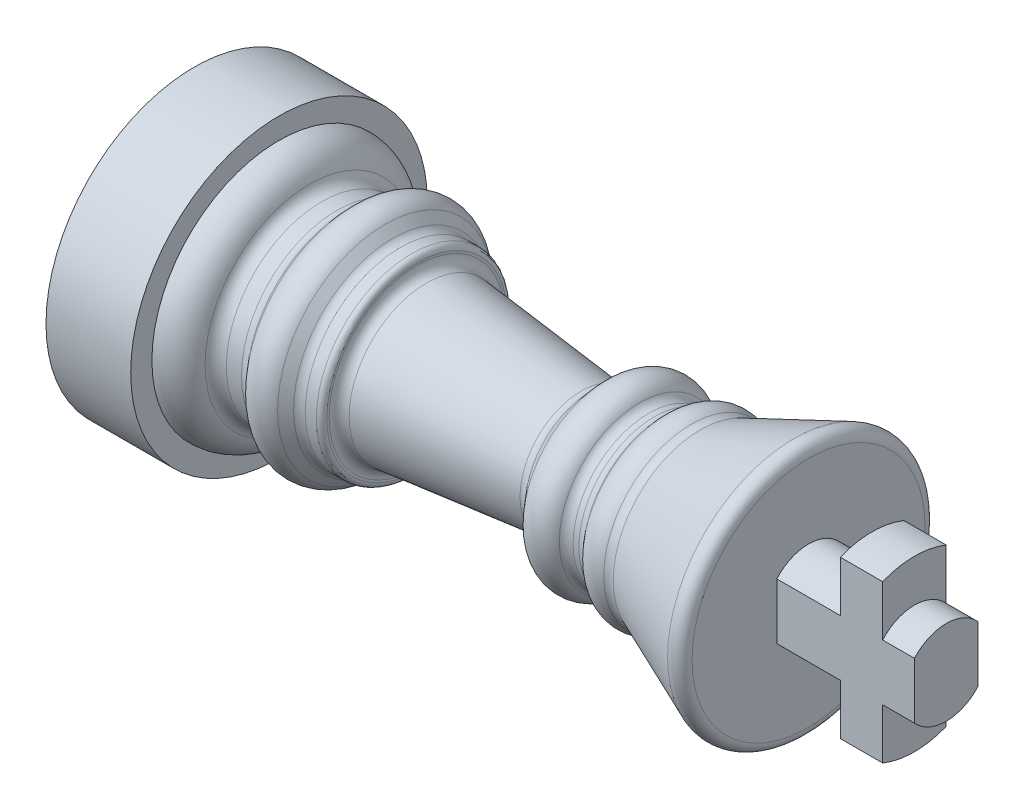
ISO-10303-21;
HEADER;
FILE_DESCRIPTION(('STEP AP214'),'2;1');
FILE_NAME('part.step','',(''),(''),'','','');
FILE_SCHEMA(('AUTOMOTIVE_DESIGN { 1 0 10303 214 1 1 1 1 }'));
ENDSEC;
DATA;
#1=APPLICATION_CONTEXT('core data for automotive mechanical design processes');
#2=APPLICATION_PROTOCOL_DEFINITION('international standard','automotive_design',2000,#1);
#3=PRODUCT_CONTEXT('',#1,'mechanical');
#4=PRODUCT('Part','Part','',(#3));
#5=PRODUCT_RELATED_PRODUCT_CATEGORY('part','',(#4));
#6=PRODUCT_DEFINITION_FORMATION('','',#4);
#7=PRODUCT_DEFINITION_CONTEXT('part definition',#1,'design');
#8=PRODUCT_DEFINITION('design','',#6,#7);
#9=PRODUCT_DEFINITION_SHAPE('','',#8);
#10=(LENGTH_UNIT() NAMED_UNIT(*) SI_UNIT(.MILLI.,.METRE.));
#11=(NAMED_UNIT(*) PLANE_ANGLE_UNIT() SI_UNIT($,.RADIAN.));
#12=(NAMED_UNIT(*) SI_UNIT($,.STERADIAN.) SOLID_ANGLE_UNIT());
#13=UNCERTAINTY_MEASURE_WITH_UNIT(LENGTH_MEASURE(1.E-05),#10,'distance_accuracy_value','');
#14=(GEOMETRIC_REPRESENTATION_CONTEXT(3) GLOBAL_UNCERTAINTY_ASSIGNED_CONTEXT((#13)) GLOBAL_UNIT_ASSIGNED_CONTEXT((#10,
#11,#12)) REPRESENTATION_CONTEXT('',''));
#15=CARTESIAN_POINT('',(0.,0.,0.));
#16=DIRECTION('',(0.,0.,1.));
#17=DIRECTION('',(1.,0.,0.));
#18=AXIS2_PLACEMENT_3D('',#15,#16,#17);
#19=CARTESIAN_POINT('',(0.,0.,0.));
#20=DIRECTION('',(-1.,0.,0.));
#21=DIRECTION('',(0.,0.,1.));
#22=AXIS2_PLACEMENT_3D('',#19,#20,#21);
#23=CYLINDRICAL_SURFACE('',#22,2.);
#24=DIRECTION('',(-1.,0.,0.));
#25=VECTOR('',#24,1.);
#26=CARTESIAN_POINT('',(0.,1.32287565553229,1.5));
#27=LINE('',#26,#25);
#28=CARTESIAN_POINT('',(31.5,1.32287565553229,1.5));
#29=VERTEX_POINT('',#28);
#30=CARTESIAN_POINT('',(28.5,1.32287565553229,1.5));
#31=VERTEX_POINT('',#30);
#32=EDGE_CURVE('E246',#29,#31,#27,.T.);
#33=ORIENTED_EDGE('',*,*,#32,.F.);
#34=CARTESIAN_POINT('',(31.5,0.,0.));
#35=DIRECTION('',(-1.,0.,0.));
#36=DIRECTION('',(0.,0.,1.));
#37=AXIS2_PLACEMENT_3D('',#34,#35,#36);
#38=CIRCLE('',#37,2.);
#39=CARTESIAN_POINT('',(31.5,1.3228756555323,-1.5));
#40=VERTEX_POINT('',#39);
#41=EDGE_CURVE('E146',#29,#40,#38,.T.);
#42=ORIENTED_EDGE('',*,*,#41,.T.);
#43=DIRECTION('',(-1.,0.,0.));
#44=VECTOR('',#43,1.);
#45=CARTESIAN_POINT('',(0.,1.32287565553229,-1.5));
#46=LINE('',#45,#44);
#47=CARTESIAN_POINT('',(28.5,1.32287565553229,-1.5));
#48=VERTEX_POINT('',#47);
#49=EDGE_CURVE('E242',#48,#40,#46,.F.);
#50=ORIENTED_EDGE('',*,*,#49,.F.);
#51=CARTESIAN_POINT('',(28.5,0.,0.));
#52=DIRECTION('',(-1.,0.,0.));
#53=DIRECTION('',(0.,0.,1.));
#54=AXIS2_PLACEMENT_3D('',#51,#52,#53);
#55=CIRCLE('',#54,2.);
#56=EDGE_CURVE('E140',#31,#48,#55,.T.);
#57=ORIENTED_EDGE('',*,*,#56,.F.);
#58=EDGE_LOOP('',(#33,#42,#50,#57));
#59=FACE_BOUND('',#58,.T.);
#60=ADVANCED_FACE('F34',(#59),#23,.T.);
#61=DIRECTION('',(-1.,0.,0.));
#62=VECTOR('',#61,1.);
#63=CARTESIAN_POINT('',(0.,-1.32287565553229,1.5));
#64=LINE('',#63,#62);
#65=CARTESIAN_POINT('',(28.5,-1.32287565553229,1.5));
#66=VERTEX_POINT('',#65);
#67=CARTESIAN_POINT('',(31.5,-1.32287565553229,1.5));
#68=VERTEX_POINT('',#67);
#69=EDGE_CURVE('E145',#66,#68,#64,.F.);
#70=ORIENTED_EDGE('',*,*,#69,.F.);
#71=CARTESIAN_POINT('',(28.5,-1.32287565553229,-1.5));
#72=VERTEX_POINT('',#71);
#73=EDGE_CURVE('E138',#72,#66,#55,.T.);
#74=ORIENTED_EDGE('',*,*,#73,.F.);
#75=DIRECTION('',(-1.,0.,0.));
#76=VECTOR('',#75,1.);
#77=CARTESIAN_POINT('',(0.,-1.32287565553229,-1.5));
#78=LINE('',#77,#76);
#79=CARTESIAN_POINT('',(31.5,-1.3228756555323,-1.5));
#80=VERTEX_POINT('',#79);
#81=EDGE_CURVE('E120',#80,#72,#78,.T.);
#82=ORIENTED_EDGE('',*,*,#81,.F.);
#83=EDGE_CURVE('E150',#80,#68,#38,.T.);
#84=ORIENTED_EDGE('',*,*,#83,.T.);
#85=EDGE_LOOP('',(#70,#74,#82,#84));
#86=FACE_BOUND('',#85,.T.);
#87=ADVANCED_FACE('F144',(#86),#23,.T.);
#88=CARTESIAN_POINT('',(31.5,4.,0.));
#89=DIRECTION('',(1.,0.,0.));
#90=DIRECTION('',(0.,0.,-1.));
#91=AXIS2_PLACEMENT_3D('',#88,#89,#90);
#92=PLANE('',#91);
#93=DIRECTION('',(0.,-1.,0.));
#94=VECTOR('',#93,1.);
#95=CARTESIAN_POINT('',(31.5,4.,1.5));
#96=LINE('',#95,#94);
#97=CARTESIAN_POINT('',(31.5,3.70809924354783,1.5));
#98=VERTEX_POINT('',#97);
#99=EDGE_CURVE('E248',#98,#29,#96,.T.);
#100=ORIENTED_EDGE('',*,*,#99,.F.);
#101=CARTESIAN_POINT('',(31.5,0.,0.));
#102=DIRECTION('',(-1.,0.,0.));
#103=DIRECTION('',(0.,0.,1.));
#104=AXIS2_PLACEMENT_3D('',#101,#102,#103);
#105=CIRCLE('',#104,4.);
#106=CARTESIAN_POINT('',(31.5,3.70809924354783,-1.5));
#107=VERTEX_POINT('',#106);
#108=EDGE_CURVE('E259',#98,#107,#105,.T.);
#109=ORIENTED_EDGE('',*,*,#108,.T.);
#110=DIRECTION('',(0.,1.,0.));
#111=VECTOR('',#110,1.);
#112=CARTESIAN_POINT('',(31.5,4.,-1.5));
#113=LINE('',#112,#111);
#114=EDGE_CURVE('E305',#40,#107,#113,.T.);
#115=ORIENTED_EDGE('',*,*,#114,.F.);
#116=ORIENTED_EDGE('',*,*,#41,.F.);
#117=EDGE_LOOP('',(#100,#109,#115,#116));
#118=FACE_BOUND('',#117,.T.);
#119=ADVANCED_FACE('F312',(#118),#92,.F.);
#120=CARTESIAN_POINT('',(31.5,-3.70809924354783,1.5));
#121=VERTEX_POINT('',#120);
#122=EDGE_CURVE('E270',#68,#121,#96,.T.);
#123=ORIENTED_EDGE('',*,*,#122,.F.);
#124=ORIENTED_EDGE('',*,*,#83,.F.);
#125=CARTESIAN_POINT('',(31.5,-3.70809924354783,-1.5));
#126=VERTEX_POINT('',#125);
#127=EDGE_CURVE('E126',#126,#80,#113,.T.);
#128=ORIENTED_EDGE('',*,*,#127,.F.);
#129=EDGE_CURVE('E258',#126,#121,#105,.T.);
#130=ORIENTED_EDGE('',*,*,#129,.T.);
#131=EDGE_LOOP('',(#123,#124,#128,#130));
#132=FACE_BOUND('',#131,.T.);
#133=ADVANCED_FACE('F269',(#132),#92,.F.);
#134=CARTESIAN_POINT('',(0.,0.,0.));
#135=DIRECTION('',(-1.,0.,0.));
#136=DIRECTION('',(0.,0.,1.));
#137=AXIS2_PLACEMENT_3D('',#134,#135,#136);
#138=CYLINDRICAL_SURFACE('',#137,4.);
#139=DIRECTION('',(-1.,0.,0.));
#140=VECTOR('',#139,1.);
#141=CARTESIAN_POINT('',(0.,3.70809924354783,1.5));
#142=LINE('',#141,#140);
#143=CARTESIAN_POINT('',(33.5,3.70809924354783,1.5));
#144=VERTEX_POINT('',#143);
#145=EDGE_CURVE('E289',#144,#98,#142,.T.);
#146=ORIENTED_EDGE('',*,*,#145,.F.);
#147=CARTESIAN_POINT('',(33.5,0.,0.));
#148=DIRECTION('',(-1.,0.,0.));
#149=DIRECTION('',(0.,0.,1.));
#150=AXIS2_PLACEMENT_3D('',#147,#148,#149);
#151=CIRCLE('',#150,4.);
#152=CARTESIAN_POINT('',(33.5,3.70809924354783,-1.5));
#153=VERTEX_POINT('',#152);
#154=EDGE_CURVE('E256',#144,#153,#151,.T.);
#155=ORIENTED_EDGE('',*,*,#154,.T.);
#156=DIRECTION('',(-1.,0.,0.));
#157=VECTOR('',#156,1.);
#158=CARTESIAN_POINT('',(0.,3.70809924354783,-1.5));
#159=LINE('',#158,#157);
#160=EDGE_CURVE('E303',#107,#153,#159,.F.);
#161=ORIENTED_EDGE('',*,*,#160,.F.);
#162=ORIENTED_EDGE('',*,*,#108,.F.);
#163=EDGE_LOOP('',(#146,#155,#161,#162));
#164=FACE_BOUND('',#163,.T.);
#165=ADVANCED_FACE('F298',(#164),#138,.T.);
#166=DIRECTION('',(-1.,0.,0.));
#167=VECTOR('',#166,1.);
#168=CARTESIAN_POINT('',(0.,-3.70809924354783,1.5));
#169=LINE('',#168,#167);
#170=CARTESIAN_POINT('',(33.5,-3.70809924354783,1.5));
#171=VERTEX_POINT('',#170);
#172=EDGE_CURVE('E278',#121,#171,#169,.F.);
#173=ORIENTED_EDGE('',*,*,#172,.F.);
#174=ORIENTED_EDGE('',*,*,#129,.F.);
#175=DIRECTION('',(-1.,0.,0.));
#176=VECTOR('',#175,1.);
#177=CARTESIAN_POINT('',(0.,-3.70809924354783,-1.5));
#178=LINE('',#177,#176);
#179=CARTESIAN_POINT('',(33.5,-3.70809924354783,-1.5));
#180=VERTEX_POINT('',#179);
#181=EDGE_CURVE('E276',#180,#126,#178,.T.);
#182=ORIENTED_EDGE('',*,*,#181,.F.);
#183=EDGE_CURVE('E255',#180,#171,#151,.T.);
#184=ORIENTED_EDGE('',*,*,#183,.T.);
#185=EDGE_LOOP('',(#173,#174,#182,#184));
#186=FACE_BOUND('',#185,.T.);
#187=ADVANCED_FACE('F274',(#186),#138,.T.);
#188=CARTESIAN_POINT('',(33.5,2.,0.));
#189=DIRECTION('',(-1.,0.,0.));
#190=DIRECTION('',(0.,0.,1.));
#191=AXIS2_PLACEMENT_3D('',#188,#189,#190);
#192=PLANE('',#191);
#193=DIRECTION('',(0.,1.,0.));
#194=VECTOR('',#193,1.);
#195=CARTESIAN_POINT('',(33.5,2.,1.5));
#196=LINE('',#195,#194);
#197=CARTESIAN_POINT('',(33.5,-1.32287565553229,1.5));
#198=VERTEX_POINT('',#197);
#199=EDGE_CURVE('E280',#171,#198,#196,.T.);
#200=ORIENTED_EDGE('',*,*,#199,.F.);
#201=ORIENTED_EDGE('',*,*,#183,.F.);
#202=DIRECTION('',(0.,-1.,0.));
#203=VECTOR('',#202,1.);
#204=CARTESIAN_POINT('',(33.5,2.,-1.5));
#205=LINE('',#204,#203);
#206=CARTESIAN_POINT('',(33.5,-1.3228756555323,-1.5));
#207=VERTEX_POINT('',#206);
#208=EDGE_CURVE('E241',#207,#180,#205,.T.);
#209=ORIENTED_EDGE('',*,*,#208,.F.);
#210=CARTESIAN_POINT('',(33.5,0.,0.));
#211=DIRECTION('',(-1.,0.,0.));
#212=DIRECTION('',(0.,0.,1.));
#213=AXIS2_PLACEMENT_3D('',#210,#211,#212);
#214=CIRCLE('',#213,2.);
#215=EDGE_CURVE('E240',#207,#198,#214,.T.);
#216=ORIENTED_EDGE('',*,*,#215,.T.);
#217=EDGE_LOOP('',(#200,#201,#209,#216));
#218=FACE_BOUND('',#217,.T.);
#219=ADVANCED_FACE('F489',(#218),#192,.F.);
#220=CARTESIAN_POINT('',(33.5,1.32287565553229,1.5));
#221=VERTEX_POINT('',#220);
#222=EDGE_CURVE('E284',#221,#144,#196,.T.);
#223=ORIENTED_EDGE('',*,*,#222,.F.);
#224=CARTESIAN_POINT('',(33.5,1.3228756555323,-1.5));
#225=VERTEX_POINT('',#224);
#226=EDGE_CURVE('E252',#221,#225,#214,.T.);
#227=ORIENTED_EDGE('',*,*,#226,.T.);
#228=EDGE_CURVE('E302',#153,#225,#205,.T.);
#229=ORIENTED_EDGE('',*,*,#228,.F.);
#230=ORIENTED_EDGE('',*,*,#154,.F.);
#231=EDGE_LOOP('',(#223,#227,#229,#230));
#232=FACE_BOUND('',#231,.T.);
#233=ADVANCED_FACE('F301',(#232),#192,.F.);
#234=CARTESIAN_POINT('',(0.,0.,0.));
#235=DIRECTION('',(-1.,0.,0.));
#236=DIRECTION('',(0.,0.,1.));
#237=AXIS2_PLACEMENT_3D('',#234,#235,#236);
#238=CYLINDRICAL_SURFACE('',#237,2.);
#239=DIRECTION('',(-1.,0.,0.));
#240=VECTOR('',#239,1.);
#241=CARTESIAN_POINT('',(0.,1.32287565553229,1.5));
#242=LINE('',#241,#240);
#243=CARTESIAN_POINT('',(35.,1.32287565553229,1.5));
#244=VERTEX_POINT('',#243);
#245=EDGE_CURVE('E288',#244,#221,#242,.T.);
#246=ORIENTED_EDGE('',*,*,#245,.F.);
#247=CARTESIAN_POINT('',(35.,0.,0.));
#248=DIRECTION('',(-1.,0.,0.));
#249=DIRECTION('',(0.,0.,1.));
#250=AXIS2_PLACEMENT_3D('',#247,#248,#249);
#251=CIRCLE('',#250,2.);
#252=CARTESIAN_POINT('',(35.,1.3228756555323,-1.5));
#253=VERTEX_POINT('',#252);
#254=EDGE_CURVE('E245',#244,#253,#251,.T.);
#255=ORIENTED_EDGE('',*,*,#254,.T.);
#256=DIRECTION('',(-1.,0.,0.));
#257=VECTOR('',#256,1.);
#258=CARTESIAN_POINT('',(0.,1.3228756555323,-1.5));
#259=LINE('',#258,#257);
#260=EDGE_CURVE('E56',#225,#253,#259,.F.);
#261=ORIENTED_EDGE('',*,*,#260,.F.);
#262=ORIENTED_EDGE('',*,*,#226,.F.);
#263=EDGE_LOOP('',(#246,#255,#261,#262));
#264=FACE_BOUND('',#263,.T.);
#265=ADVANCED_FACE('F484',(#264),#238,.T.);
#266=DIRECTION('',(-1.,0.,0.));
#267=VECTOR('',#266,1.);
#268=CARTESIAN_POINT('',(0.,-1.32287565553229,1.5));
#269=LINE('',#268,#267);
#270=CARTESIAN_POINT('',(35.,-1.32287565553229,1.5));
#271=VERTEX_POINT('',#270);
#272=EDGE_CURVE('E48',#198,#271,#269,.F.);
#273=ORIENTED_EDGE('',*,*,#272,.F.);
#274=ORIENTED_EDGE('',*,*,#215,.F.);
#275=DIRECTION('',(-1.,0.,0.));
#276=VECTOR('',#275,1.);
#277=CARTESIAN_POINT('',(0.,-1.3228756555323,-1.5));
#278=LINE('',#277,#276);
#279=CARTESIAN_POINT('',(35.,-1.3228756555323,-1.5));
#280=VERTEX_POINT('',#279);
#281=EDGE_CURVE('E228',#280,#207,#278,.T.);
#282=ORIENTED_EDGE('',*,*,#281,.F.);
#283=EDGE_CURVE('E238',#280,#271,#251,.T.);
#284=ORIENTED_EDGE('',*,*,#283,.T.);
#285=EDGE_LOOP('',(#273,#274,#282,#284));
#286=FACE_BOUND('',#285,.T.);
#287=ADVANCED_FACE('F237',(#286),#238,.T.);
#288=CARTESIAN_POINT('',(35.,0.,0.));
#289=DIRECTION('',(-1.,0.,0.));
#290=DIRECTION('',(0.,0.,1.));
#291=AXIS2_PLACEMENT_3D('',#288,#289,#290);
#292=PLANE('',#291);
#293=DIRECTION('',(0.,1.,0.));
#294=VECTOR('',#293,1.);
#295=CARTESIAN_POINT('',(35.,0.,1.5));
#296=LINE('',#295,#294);
#297=EDGE_CURVE('E12',#271,#244,#296,.T.);
#298=ORIENTED_EDGE('',*,*,#297,.F.);
#299=ORIENTED_EDGE('',*,*,#283,.F.);
#300=DIRECTION('',(0.,-1.,0.));
#301=VECTOR('',#300,1.);
#302=CARTESIAN_POINT('',(35.,0.,-1.5));
#303=LINE('',#302,#301);
#304=EDGE_CURVE('E42',#253,#280,#303,.T.);
#305=ORIENTED_EDGE('',*,*,#304,.F.);
#306=ORIENTED_EDGE('',*,*,#254,.F.);
#307=EDGE_LOOP('',(#298,#299,#305,#306));
#308=FACE_BOUND('',#307,.T.);
#309=ADVANCED_FACE('F244',(#308),#292,.F.);
#310=CARTESIAN_POINT('',(3.5,0.,0.));
#311=DIRECTION('',(-1.,0.,0.));
#312=DIRECTION('',(0.,0.,1.));
#313=AXIS2_PLACEMENT_3D('',#310,#311,#312);
#314=TOROIDAL_SURFACE('',#313,4.5,1.5);
#315=CARTESIAN_POINT('',(3.5,0.,0.));
#316=DIRECTION('',(-1.,0.,0.));
#317=DIRECTION('',(0.,0.,1.));
#318=AXIS2_PLACEMENT_3D('',#315,#316,#317);
#319=CIRCLE('',#318,6.);
#320=CARTESIAN_POINT('',(3.5,0.,6.));
#321=VERTEX_POINT('',#320);
#322=EDGE_CURVE('E219',#321,#321,#319,.T.);
#323=ORIENTED_EDGE('',*,*,#322,.F.);
#324=EDGE_LOOP('',(#323));
#325=FACE_BOUND('',#324,.T.);
#326=CARTESIAN_POINT('',(4.93747227124987,0.,0.));
#327=DIRECTION('',(-1.,0.,0.));
#328=DIRECTION('',(0.,0.,1.));
#329=AXIS2_PLACEMENT_3D('',#326,#327,#328);
#330=CIRCLE('',#329,4.92857142857143);
#331=CARTESIAN_POINT('',(4.93747227124987,0.,4.92857142857143));
#332=VERTEX_POINT('',#331);
#333=EDGE_CURVE('E216',#332,#332,#330,.T.);
#334=ORIENTED_EDGE('',*,*,#333,.T.);
#335=EDGE_LOOP('',(#334));
#336=FACE_BOUND('',#335,.T.);
#337=ADVANCED_FACE('F453',(#325,#336),#314,.T.);
#338=CARTESIAN_POINT('',(5.51246117974981,0.,0.));
#339=DIRECTION('',(-1.,0.,0.));
#340=DIRECTION('',(0.,0.,1.));
#341=AXIS2_PLACEMENT_3D('',#338,#339,#340);
#342=TOROIDAL_SURFACE('',#341,5.1,0.599999999999999);
#343=ORIENTED_EDGE('',*,*,#333,.F.);
#344=EDGE_LOOP('',(#343));
#345=FACE_BOUND('',#344,.T.);
#346=CARTESIAN_POINT('',(5.51246117974981,0.,0.));
#347=DIRECTION('',(-1.,0.,0.));
#348=DIRECTION('',(0.,0.,1.));
#349=AXIS2_PLACEMENT_3D('',#346,#347,#348);
#350=CIRCLE('',#349,4.5);
#351=CARTESIAN_POINT('',(5.51246117974981,0.,4.5));
#352=VERTEX_POINT('',#351);
#353=EDGE_CURVE('E213',#352,#352,#350,.T.);
#354=ORIENTED_EDGE('',*,*,#353,.T.);
#355=EDGE_LOOP('',(#354));
#356=FACE_BOUND('',#355,.T.);
#357=ADVANCED_FACE('F450',(#345,#356),#342,.F.);
#358=CARTESIAN_POINT('',(0.,0.,0.));
#359=DIRECTION('',(-1.,0.,0.));
#360=DIRECTION('',(0.,0.,1.));
#361=AXIS2_PLACEMENT_3D('',#358,#359,#360);
#362=CYLINDRICAL_SURFACE('',#361,4.5);
#363=ORIENTED_EDGE('',*,*,#353,.F.);
#364=EDGE_LOOP('',(#363));
#365=FACE_BOUND('',#364,.T.);
#366=CARTESIAN_POINT('',(6.227646036584,0.,0.));
#367=DIRECTION('',(-1.,0.,0.));
#368=DIRECTION('',(0.,0.,1.));
#369=AXIS2_PLACEMENT_3D('',#366,#367,#368);
#370=CIRCLE('',#369,4.5);
#371=CARTESIAN_POINT('',(6.227646036584,0.,4.5));
#372=VERTEX_POINT('',#371);
#373=EDGE_CURVE('E210',#372,#372,#370,.T.);
#374=ORIENTED_EDGE('',*,*,#373,.T.);
#375=EDGE_LOOP('',(#374));
#376=FACE_BOUND('',#375,.T.);
#377=ADVANCED_FACE('F446',(#365,#376),#362,.T.);
#378=CARTESIAN_POINT('',(6.227646036584,0.,0.));
#379=DIRECTION('',(-1.,0.,0.));
#380=DIRECTION('',(0.,0.,1.));
#381=AXIS2_PLACEMENT_3D('',#378,#379,#380);
#382=TOROIDAL_SURFACE('',#381,5.1,0.599999999999998);
#383=ORIENTED_EDGE('',*,*,#373,.F.);
#384=EDGE_LOOP('',(#383));
#385=FACE_BOUND('',#384,.T.);
#386=CARTESIAN_POINT('',(6.68047178471766,0.,0.));
#387=DIRECTION('',(-1.,0.,0.));
#388=DIRECTION('',(0.,0.,1.));
#389=AXIS2_PLACEMENT_3D('',#386,#387,#388);
#390=CIRCLE('',#389,4.7063645826057);
#391=CARTESIAN_POINT('',(6.68047178471766,0.,4.7063645826057));
#392=VERTEX_POINT('',#391);
#393=EDGE_CURVE('E207',#392,#392,#390,.T.);
#394=ORIENTED_EDGE('',*,*,#393,.T.);
#395=EDGE_LOOP('',(#394));
#396=FACE_BOUND('',#395,.T.);
#397=ADVANCED_FACE('F442',(#385,#396),#382,.F.);
#398=CARTESIAN_POINT('',(7.00108178990356,0.,0.));
#399=DIRECTION('',(1.,0.,0.));
#400=DIRECTION('',(0.,0.,-1.));
#401=AXIS2_PLACEMENT_3D('',#398,#399,#400);
#402=CONICAL_SURFACE('',#401,5.07518420361052,0.855211333477219);
#403=ORIENTED_EDGE('',*,*,#393,.F.);
#404=EDGE_LOOP('',(#403));
#405=FACE_BOUND('',#404,.T.);
#406=CARTESIAN_POINT('',(7.00108178990356,0.,0.));
#407=DIRECTION('',(-1.,0.,0.));
#408=DIRECTION('',(0.,0.,1.));
#409=AXIS2_PLACEMENT_3D('',#406,#407,#408);
#410=CIRCLE('',#409,5.07518420361052);
#411=CARTESIAN_POINT('',(7.00108178990356,0.,5.07518420361052));
#412=VERTEX_POINT('',#411);
#413=EDGE_CURVE('E204',#412,#412,#410,.T.);
#414=ORIENTED_EDGE('',*,*,#413,.T.);
#415=EDGE_LOOP('',(#414));
#416=FACE_BOUND('',#415,.T.);
#417=ADVANCED_FACE('F438',(#405,#416),#402,.T.);
#418=CARTESIAN_POINT('',(7.75579137012633,0.,0.));
#419=DIRECTION('',(-1.,0.,0.));
#420=DIRECTION('',(0.,0.,1.));
#421=AXIS2_PLACEMENT_3D('',#418,#419,#420);
#422=TOROIDAL_SURFACE('',#421,4.41912517462001,1.);
#423=ORIENTED_EDGE('',*,*,#413,.F.);
#424=EDGE_LOOP('',(#423));
#425=FACE_BOUND('',#424,.T.);
#426=CARTESIAN_POINT('',(8.51050095034911,0.,0.));
#427=DIRECTION('',(-1.,0.,0.));
#428=DIRECTION('',(0.,0.,1.));
#429=AXIS2_PLACEMENT_3D('',#426,#427,#428);
#430=CIRCLE('',#429,5.07518420361051);
#431=CARTESIAN_POINT('',(8.51050095034911,0.,5.07518420361051));
#432=VERTEX_POINT('',#431);
#433=EDGE_CURVE('E201',#432,#432,#430,.T.);
#434=ORIENTED_EDGE('',*,*,#433,.T.);
#435=EDGE_LOOP('',(#434));
#436=FACE_BOUND('',#435,.T.);
#437=ADVANCED_FACE('F434',(#425,#436),#422,.T.);
#438=CARTESIAN_POINT('',(8.86100928800401,0.,0.));
#439=DIRECTION('',(-1.,0.,0.));
#440=DIRECTION('',(0.,0.,1.));
#441=AXIS2_PLACEMENT_3D('',#438,#439,#440);
#442=CONICAL_SURFACE('',#441,4.67197048550475,0.855211333477227);
#443=ORIENTED_EDGE('',*,*,#433,.F.);
#444=EDGE_LOOP('',(#443));
#445=FACE_BOUND('',#444,.T.);
#446=CARTESIAN_POINT('',(8.86100928800401,0.,0.));
#447=DIRECTION('',(-1.,0.,0.));
#448=DIRECTION('',(0.,0.,1.));
#449=AXIS2_PLACEMENT_3D('',#446,#447,#448);
#450=CIRCLE('',#449,4.67197048550475);
#451=CARTESIAN_POINT('',(8.86100928800401,0.,4.67197048550475));
#452=VERTEX_POINT('',#451);
#453=EDGE_CURVE('E198',#452,#452,#450,.T.);
#454=ORIENTED_EDGE('',*,*,#453,.T.);
#455=EDGE_LOOP('',(#454));
#456=FACE_BOUND('',#455,.T.);
#457=ADVANCED_FACE('F430',(#445,#456),#442,.T.);
#458=CARTESIAN_POINT('',(9.2383640781154,0.,0.));
#459=DIRECTION('',(-1.,0.,0.));
#460=DIRECTION('',(0.,0.,1.));
#461=AXIS2_PLACEMENT_3D('',#458,#459,#460);
#462=TOROIDAL_SURFACE('',#461,5.,0.5);
#463=ORIENTED_EDGE('',*,*,#453,.F.);
#464=EDGE_LOOP('',(#463));
#465=FACE_BOUND('',#464,.T.);
#466=CARTESIAN_POINT('',(9.2383640781154,0.,0.));
#467=DIRECTION('',(-1.,0.,0.));
#468=DIRECTION('',(0.,0.,1.));
#469=AXIS2_PLACEMENT_3D('',#466,#467,#468);
#470=CIRCLE('',#469,4.5);
#471=CARTESIAN_POINT('',(9.2383640781154,0.,4.5));
#472=VERTEX_POINT('',#471);
#473=EDGE_CURVE('E195',#472,#472,#470,.T.);
#474=ORIENTED_EDGE('',*,*,#473,.T.);
#475=EDGE_LOOP('',(#474));
#476=FACE_BOUND('',#475,.T.);
#477=ADVANCED_FACE('F426',(#465,#476),#462,.F.);
#478=CARTESIAN_POINT('',(0.,0.,0.));
#479=DIRECTION('',(-1.,0.,0.));
#480=DIRECTION('',(0.,0.,1.));
#481=AXIS2_PLACEMENT_3D('',#478,#479,#480);
#482=CYLINDRICAL_SURFACE('',#481,4.5);
#483=CARTESIAN_POINT('',(9.76050095034911,0.,0.));
#484=DIRECTION('',(-1.,0.,0.));
#485=DIRECTION('',(0.,0.,1.));
#486=AXIS2_PLACEMENT_3D('',#483,#484,#485);
#487=CIRCLE('',#486,4.5);
#488=CARTESIAN_POINT('',(9.76050095034911,0.,4.5));
#489=VERTEX_POINT('',#488);
#490=EDGE_CURVE('E222',#489,#489,#487,.T.);
#491=ORIENTED_EDGE('',*,*,#490,.T.);
#492=EDGE_LOOP('',(#491));
#493=FACE_BOUND('',#492,.T.);
#494=ORIENTED_EDGE('',*,*,#473,.F.);
#495=EDGE_LOOP('',(#494));
#496=FACE_BOUND('',#495,.T.);
#497=ADVANCED_FACE('F422',(#493,#496),#482,.T.);
#498=CARTESIAN_POINT('',(10.0105009503491,4.5,0.));
#499=DIRECTION('',(-1.,0.,0.));
#500=DIRECTION('',(0.,0.,1.));
#501=AXIS2_PLACEMENT_3D('',#498,#499,#500);
#502=PLANE('',#501);
#503=CARTESIAN_POINT('',(10.0105009503491,0.,0.));
#504=DIRECTION('',(-1.,0.,0.));
#505=DIRECTION('',(0.,0.,1.));
#506=AXIS2_PLACEMENT_3D('',#503,#504,#505);
#507=CIRCLE('',#506,4.25);
#508=CARTESIAN_POINT('',(10.0105009503491,0.,4.25));
#509=VERTEX_POINT('',#508);
#510=EDGE_CURVE('E225',#509,#509,#507,.F.);
#511=ORIENTED_EDGE('',*,*,#510,.T.);
#512=EDGE_LOOP('',(#511));
#513=FACE_BOUND('',#512,.T.);
#514=CARTESIAN_POINT('',(10.0105009503491,0.,0.));
#515=DIRECTION('',(-1.,0.,0.));
#516=DIRECTION('',(0.,0.,1.));
#517=AXIS2_PLACEMENT_3D('',#514,#515,#516);
#518=CIRCLE('',#517,4.14516944142962);
#519=CARTESIAN_POINT('',(10.0105009503491,0.,4.14516944142962));
#520=VERTEX_POINT('',#519);
#521=EDGE_CURVE('E192',#520,#520,#518,.T.);
#522=ORIENTED_EDGE('',*,*,#521,.T.);
#523=EDGE_LOOP('',(#522));
#524=FACE_BOUND('',#523,.T.);
#525=ADVANCED_FACE('F418',(#513,#524),#502,.F.);
#526=CARTESIAN_POINT('',(10.5105009503491,0.,0.));
#527=DIRECTION('',(-1.,0.,0.));
#528=DIRECTION('',(0.,0.,1.));
#529=AXIS2_PLACEMENT_3D('',#526,#527,#528);
#530=TOROIDAL_SURFACE('',#529,4.14516944142962,0.500000000000001);
#531=ORIENTED_EDGE('',*,*,#521,.F.);
#532=EDGE_LOOP('',(#531));
#533=FACE_BOUND('',#532,.T.);
#534=CARTESIAN_POINT('',(10.4582367187153,0.,0.));
#535=DIRECTION('',(-1.,0.,0.));
#536=DIRECTION('',(0.,0.,1.));
#537=AXIS2_PLACEMENT_3D('',#534,#535,#536);
#538=CIRCLE('',#537,3.64790849374549);
#539=CARTESIAN_POINT('',(10.4582367187153,0.,3.64790849374549));
#540=VERTEX_POINT('',#539);
#541=EDGE_CURVE('E189',#540,#540,#538,.T.);
#542=ORIENTED_EDGE('',*,*,#541,.T.);
#543=EDGE_LOOP('',(#542));
#544=FACE_BOUND('',#543,.T.);
#545=ADVANCED_FACE('F414',(#533,#544),#530,.F.);
#546=CARTESIAN_POINT('',(17.7591010110446,0.,0.));
#547=DIRECTION('',(-1.,0.,0.));
#548=DIRECTION('',(0.,0.,1.));
#549=AXIS2_PLACEMENT_3D('',#546,#547,#548);
#550=CONICAL_SURFACE('',#549,2.88055673552174,0.104719755119659);
#551=ORIENTED_EDGE('',*,*,#541,.F.);
#552=EDGE_LOOP('',(#551));
#553=FACE_BOUND('',#552,.T.);
#554=CARTESIAN_POINT('',(17.7591010110446,0.,0.));
#555=DIRECTION('',(-1.,0.,0.));
#556=DIRECTION('',(0.,0.,1.));
#557=AXIS2_PLACEMENT_3D('',#554,#555,#556);
#558=CIRCLE('',#557,2.88055673552174);
#559=CARTESIAN_POINT('',(17.7591010110446,0.,2.88055673552174));
#560=VERTEX_POINT('',#559);
#561=EDGE_CURVE('E186',#560,#560,#558,.T.);
#562=ORIENTED_EDGE('',*,*,#561,.T.);
#563=EDGE_LOOP('',(#562));
#564=FACE_BOUND('',#563,.T.);
#565=ADVANCED_FACE('F410',(#553,#564),#550,.T.);
#566=CARTESIAN_POINT('',(17.8113652426784,0.,0.));
#567=DIRECTION('',(-1.,0.,0.));
#568=DIRECTION('',(0.,0.,1.));
#569=AXIS2_PLACEMENT_3D('',#566,#567,#568);
#570=TOROIDAL_SURFACE('',#569,3.37781768320587,0.499999999999998);
#571=ORIENTED_EDGE('',*,*,#561,.F.);
#572=EDGE_LOOP('',(#571));
#573=FACE_BOUND('',#572,.T.);
#574=CARTESIAN_POINT('',(18.1887200327898,0.,0.));
#575=DIRECTION('',(-1.,0.,0.));
#576=DIRECTION('',(0.,0.,1.));
#577=AXIS2_PLACEMENT_3D('',#574,#575,#576);
#578=CIRCLE('',#577,3.04978816871062);
#579=CARTESIAN_POINT('',(18.1887200327898,0.,3.04978816871062));
#580=VERTEX_POINT('',#579);
#581=EDGE_CURVE('E183',#580,#580,#578,.T.);
#582=ORIENTED_EDGE('',*,*,#581,.T.);
#583=EDGE_LOOP('',(#582));
#584=FACE_BOUND('',#583,.T.);
#585=ADVANCED_FACE('F406',(#573,#584),#570,.F.);
#586=CARTESIAN_POINT('',(18.9330649356096,0.,0.));
#587=DIRECTION('',(1.,0.,0.));
#588=DIRECTION('',(0.,0.,-1.));
#589=AXIS2_PLACEMENT_3D('',#586,#587,#588);
#590=CONICAL_SURFACE('',#589,3.90605902899051,0.855211333477217);
#591=ORIENTED_EDGE('',*,*,#581,.F.);
#592=EDGE_LOOP('',(#591));
#593=FACE_BOUND('',#592,.T.);
#594=CARTESIAN_POINT('',(18.9330649356096,0.,0.));
#595=DIRECTION('',(-1.,0.,0.));
#596=DIRECTION('',(0.,0.,1.));
#597=AXIS2_PLACEMENT_3D('',#594,#595,#596);
#598=CIRCLE('',#597,3.90605902899051);
#599=CARTESIAN_POINT('',(18.9330649356096,0.,3.90605902899051));
#600=VERTEX_POINT('',#599);
#601=EDGE_CURVE('E180',#600,#600,#598,.T.);
#602=ORIENTED_EDGE('',*,*,#601,.T.);
#603=EDGE_LOOP('',(#602));
#604=FACE_BOUND('',#603,.T.);
#605=ADVANCED_FACE('F402',(#593,#604),#590,.T.);
#606=CARTESIAN_POINT('',(19.6877745158324,0.,0.));
#607=DIRECTION('',(-1.,0.,0.));
#608=DIRECTION('',(0.,0.,1.));
#609=AXIS2_PLACEMENT_3D('',#606,#607,#608);
#610=TOROIDAL_SURFACE('',#609,3.25,1.);
#611=ORIENTED_EDGE('',*,*,#601,.F.);
#612=EDGE_LOOP('',(#611));
#613=FACE_BOUND('',#612,.T.);
#614=CARTESIAN_POINT('',(20.5277926651099,0.,0.));
#615=DIRECTION('',(-1.,0.,0.));
#616=DIRECTION('',(0.,0.,1.));
#617=AXIS2_PLACEMENT_3D('',#614,#615,#616);
#618=CIRCLE('',#617,3.79255829998655);
#619=CARTESIAN_POINT('',(20.5277926651099,0.,3.79255829998655));
#620=VERTEX_POINT('',#619);
#621=EDGE_CURVE('E177',#620,#620,#618,.T.);
#622=ORIENTED_EDGE('',*,*,#621,.T.);
#623=EDGE_LOOP('',(#622));
#624=FACE_BOUND('',#623,.T.);
#625=ADVANCED_FACE('F398',(#613,#624),#610,.T.);
#626=CARTESIAN_POINT('',(20.9478017397487,0.,0.));
#627=DIRECTION('',(-1.,0.,0.));
#628=DIRECTION('',(0.,0.,1.));
#629=AXIS2_PLACEMENT_3D('',#626,#627,#628);
#630=TOROIDAL_SURFACE('',#629,4.06383744997983,0.5);
#631=ORIENTED_EDGE('',*,*,#621,.F.);
#632=EDGE_LOOP('',(#631));
#633=FACE_BOUND('',#632,.T.);
#634=CARTESIAN_POINT('',(20.9478017397487,0.,0.));
#635=DIRECTION('',(-1.,0.,0.));
#636=DIRECTION('',(0.,0.,1.));
#637=AXIS2_PLACEMENT_3D('',#634,#635,#636);
#638=CIRCLE('',#637,3.56383744997983);
#639=CARTESIAN_POINT('',(20.9478017397487,0.,3.56383744997983));
#640=VERTEX_POINT('',#639);
#641=EDGE_CURVE('E174',#640,#640,#638,.T.);
#642=ORIENTED_EDGE('',*,*,#641,.T.);
#643=EDGE_LOOP('',(#642));
#644=FACE_BOUND('',#643,.T.);
#645=ADVANCED_FACE('F394',(#633,#644),#630,.F.);
#646=CARTESIAN_POINT('',(0.,0.,0.));
#647=DIRECTION('',(-1.,0.,0.));
#648=DIRECTION('',(0.,0.,1.));
#649=AXIS2_PLACEMENT_3D('',#646,#647,#648);
#650=CYLINDRICAL_SURFACE('',#649,3.56383744997983);
#651=ORIENTED_EDGE('',*,*,#641,.F.);
#652=EDGE_LOOP('',(#651));
#653=FACE_BOUND('',#652,.T.);
#654=CARTESIAN_POINT('',(21.2199386119824,0.,0.));
#655=DIRECTION('',(-1.,0.,0.));
#656=DIRECTION('',(0.,0.,1.));
#657=AXIS2_PLACEMENT_3D('',#654,#655,#656);
#658=CIRCLE('',#657,3.56383744997984);
#659=CARTESIAN_POINT('',(21.2199386119824,0.,3.56383744997984));
#660=VERTEX_POINT('',#659);
#661=EDGE_CURVE('E171',#660,#660,#658,.T.);
#662=ORIENTED_EDGE('',*,*,#661,.T.);
#663=EDGE_LOOP('',(#662));
#664=FACE_BOUND('',#663,.T.);
#665=ADVANCED_FACE('F390',(#653,#664),#650,.T.);
#666=CARTESIAN_POINT('',(21.2199386119824,0.,0.));
#667=DIRECTION('',(-1.,0.,0.));
#668=DIRECTION('',(0.,0.,1.));
#669=AXIS2_PLACEMENT_3D('',#666,#667,#668);
#670=TOROIDAL_SURFACE('',#669,4.06383744997982,0.499999999999993);
#671=ORIENTED_EDGE('',*,*,#661,.F.);
#672=EDGE_LOOP('',(#671));
#673=FACE_BOUND('',#672,.T.);
#674=CARTESIAN_POINT('',(21.5972934020938,0.,0.));
#675=DIRECTION('',(-1.,0.,0.));
#676=DIRECTION('',(0.,0.,1.));
#677=AXIS2_PLACEMENT_3D('',#674,#675,#676);
#678=CIRCLE('',#677,3.73580793548459);
#679=CARTESIAN_POINT('',(21.5972934020938,0.,3.73580793548459));
#680=VERTEX_POINT('',#679);
#681=EDGE_CURVE('E168',#680,#680,#678,.T.);
#682=ORIENTED_EDGE('',*,*,#681,.T.);
#683=EDGE_LOOP('',(#682));
#684=FACE_BOUND('',#683,.T.);
#685=ADVANCED_FACE('F386',(#673,#684),#670,.F.);
#686=CARTESIAN_POINT('',(21.7452904197772,0.,0.));
#687=DIRECTION('',(1.,0.,0.));
#688=DIRECTION('',(0.,0.,-1.));
#689=AXIS2_PLACEMENT_3D('',#686,#687,#688);
#690=CONICAL_SURFACE('',#689,3.90605902899051,0.855211333477179);
#691=ORIENTED_EDGE('',*,*,#681,.F.);
#692=EDGE_LOOP('',(#691));
#693=FACE_BOUND('',#692,.T.);
#694=CARTESIAN_POINT('',(21.7452904197772,0.,0.));
#695=DIRECTION('',(-1.,0.,0.));
#696=DIRECTION('',(0.,0.,1.));
#697=AXIS2_PLACEMENT_3D('',#694,#695,#696);
#698=CIRCLE('',#697,3.90605902899051);
#699=CARTESIAN_POINT('',(21.7452904197772,0.,3.90605902899051));
#700=VERTEX_POINT('',#699);
#701=EDGE_CURVE('E165',#700,#700,#698,.T.);
#702=ORIENTED_EDGE('',*,*,#701,.T.);
#703=EDGE_LOOP('',(#702));
#704=FACE_BOUND('',#703,.T.);
#705=ADVANCED_FACE('F382',(#693,#704),#690,.T.);
#706=CARTESIAN_POINT('',(22.5,0.,0.));
#707=DIRECTION('',(-1.,0.,0.));
#708=DIRECTION('',(0.,0.,1.));
#709=AXIS2_PLACEMENT_3D('',#706,#707,#708);
#710=TOROIDAL_SURFACE('',#709,3.25,0.999999999999999);
#711=ORIENTED_EDGE('',*,*,#701,.F.);
#712=EDGE_LOOP('',(#711));
#713=FACE_BOUND('',#712,.T.);
#714=CARTESIAN_POINT('',(22.9670764444107,0.,0.));
#715=DIRECTION('',(-1.,0.,0.));
#716=DIRECTION('',(0.,0.,1.));
#717=AXIS2_PLACEMENT_3D('',#714,#715,#716);
#718=CIRCLE('',#717,4.13421693892206);
#719=CARTESIAN_POINT('',(22.9670764444107,0.,4.13421693892206));
#720=VERTEX_POINT('',#719);
#721=EDGE_CURVE('E162',#720,#720,#718,.T.);
#722=ORIENTED_EDGE('',*,*,#721,.T.);
#723=EDGE_LOOP('',(#722));
#724=FACE_BOUND('',#723,.T.);
#725=ADVANCED_FACE('F378',(#713,#724),#710,.T.);
#726=CARTESIAN_POINT('',(23.200614666616,0.,0.));
#727=DIRECTION('',(-1.,0.,0.));
#728=DIRECTION('',(0.,0.,1.));
#729=AXIS2_PLACEMENT_3D('',#726,#727,#728);
#730=TOROIDAL_SURFACE('',#729,4.57632540838309,0.5);
#731=ORIENTED_EDGE('',*,*,#721,.F.);
#732=EDGE_LOOP('',(#731));
#733=FACE_BOUND('',#732,.T.);
#734=CARTESIAN_POINT('',(23.3935689598591,0.,0.));
#735=DIRECTION('',(-1.,0.,0.));
#736=DIRECTION('',(0.,0.,1.));
#737=AXIS2_PLACEMENT_3D('',#734,#735,#736);
#738=CIRCLE('',#737,4.11505689578001);
#739=CARTESIAN_POINT('',(23.3935689598591,0.,4.11505689578001));
#740=VERTEX_POINT('',#739);
#741=EDGE_CURVE('E159',#740,#740,#738,.T.);
#742=ORIENTED_EDGE('',*,*,#741,.T.);
#743=EDGE_LOOP('',(#742));
#744=FACE_BOUND('',#743,.T.);
#745=ADVANCED_FACE('F374',(#733,#744),#730,.F.);
#746=CARTESIAN_POINT('',(27.8070457067569,0.,0.));
#747=DIRECTION('',(1.,0.,0.));
#748=DIRECTION('',(0.,0.,-1.));
#749=AXIS2_PLACEMENT_3D('',#746,#747,#748);
#750=CONICAL_SURFACE('',#749,5.96126851260308,0.396192497989486);
#751=ORIENTED_EDGE('',*,*,#741,.F.);
#752=EDGE_LOOP('',(#751));
#753=FACE_BOUND('',#752,.T.);
#754=CARTESIAN_POINT('',(27.8070457067569,0.,0.));
#755=DIRECTION('',(-1.,0.,0.));
#756=DIRECTION('',(0.,0.,1.));
#757=AXIS2_PLACEMENT_3D('',#754,#755,#756);
#758=CIRCLE('',#757,5.96126851260308);
#759=CARTESIAN_POINT('',(27.8070457067569,0.,5.96126851260308));
#760=VERTEX_POINT('',#759);
#761=EDGE_CURVE('E156',#760,#760,#758,.T.);
#762=ORIENTED_EDGE('',*,*,#761,.T.);
#763=EDGE_LOOP('',(#762));
#764=FACE_BOUND('',#763,.T.);
#765=ADVANCED_FACE('F370',(#753,#764),#750,.T.);
#766=CARTESIAN_POINT('',(28.,0.,0.));
#767=DIRECTION('',(-1.,0.,0.));
#768=DIRECTION('',(0.,0.,1.));
#769=AXIS2_PLACEMENT_3D('',#766,#767,#768);
#770=TOROIDAL_SURFACE('',#769,5.5,0.5);
#771=ORIENTED_EDGE('',*,*,#761,.F.);
#772=EDGE_LOOP('',(#771));
#773=FACE_BOUND('',#772,.T.);
#774=CARTESIAN_POINT('',(28.5,0.,0.));
#775=DIRECTION('',(-1.,0.,0.));
#776=DIRECTION('',(0.,0.,1.));
#777=AXIS2_PLACEMENT_3D('',#774,#775,#776);
#778=CIRCLE('',#777,5.5);
#779=CARTESIAN_POINT('',(28.5,0.,5.5));
#780=VERTEX_POINT('',#779);
#781=EDGE_CURVE('E148',#780,#780,#778,.T.);
#782=ORIENTED_EDGE('',*,*,#781,.T.);
#783=EDGE_LOOP('',(#782));
#784=FACE_BOUND('',#783,.T.);
#785=ADVANCED_FACE('F367',(#773,#784),#770,.T.);
#786=CARTESIAN_POINT('',(28.5,2.,0.));
#787=DIRECTION('',(-1.,0.,0.));
#788=DIRECTION('',(0.,0.,1.));
#789=AXIS2_PLACEMENT_3D('',#786,#787,#788);
#790=PLANE('',#789);
#791=ORIENTED_EDGE('',*,*,#73,.T.);
#792=DIRECTION('',(0.,-1.,0.));
#793=VECTOR('',#792,1.);
#794=CARTESIAN_POINT('',(28.5,-4.5,1.5));
#795=LINE('',#794,#793);
#796=EDGE_CURVE('E141',#31,#66,#795,.T.);
#797=ORIENTED_EDGE('',*,*,#796,.F.);
#798=ORIENTED_EDGE('',*,*,#56,.T.);
#799=DIRECTION('',(0.,1.,0.));
#800=VECTOR('',#799,1.);
#801=CARTESIAN_POINT('',(28.5,4.5,-1.5));
#802=LINE('',#801,#800);
#803=EDGE_CURVE('E123',#72,#48,#802,.T.);
#804=ORIENTED_EDGE('',*,*,#803,.F.);
#805=EDGE_LOOP('',(#791,#797,#798,#804));
#806=FACE_BOUND('',#805,.T.);
#807=ORIENTED_EDGE('',*,*,#781,.F.);
#808=EDGE_LOOP('',(#807));
#809=FACE_BOUND('',#808,.T.);
#810=ADVANCED_FACE('F135',(#806,#809),#790,.F.);
#811=CARTESIAN_POINT('',(9.76050095034911,0.,0.));
#812=DIRECTION('',(-1.,0.,0.));
#813=DIRECTION('',(0.,0.,1.));
#814=AXIS2_PLACEMENT_3D('',#811,#812,#813);
#815=TOROIDAL_SURFACE('',#814,4.25,0.25);
#816=ORIENTED_EDGE('',*,*,#510,.F.);
#817=EDGE_LOOP('',(#816));
#818=FACE_BOUND('',#817,.T.);
#819=ORIENTED_EDGE('',*,*,#490,.F.);
#820=EDGE_LOOP('',(#819));
#821=FACE_BOUND('',#820,.T.);
#822=ADVANCED_FACE('F36',(#818,#821),#815,.T.);
#823=CARTESIAN_POINT('',(11.3597316240381,4.5,-1.5));
#824=DIRECTION('',(0.,0.,-1.));
#825=DIRECTION('',(0.,1.,0.));
#826=AXIS2_PLACEMENT_3D('',#823,#824,#825);
#827=PLANE('',#826);
#828=ORIENTED_EDGE('',*,*,#81,.T.);
#829=ORIENTED_EDGE('',*,*,#803,.T.);
#830=ORIENTED_EDGE('',*,*,#49,.T.);
#831=ORIENTED_EDGE('',*,*,#114,.T.);
#832=ORIENTED_EDGE('',*,*,#160,.T.);
#833=ORIENTED_EDGE('',*,*,#228,.T.);
#834=ORIENTED_EDGE('',*,*,#260,.T.);
#835=ORIENTED_EDGE('',*,*,#304,.T.);
#836=ORIENTED_EDGE('',*,*,#281,.T.);
#837=ORIENTED_EDGE('',*,*,#208,.T.);
#838=ORIENTED_EDGE('',*,*,#181,.T.);
#839=ORIENTED_EDGE('',*,*,#127,.T.);
#840=EDGE_LOOP('',(#828,#829,#830,#831,#832,#833,#834,#835,#836,#837,#838,#839));
#841=FACE_BOUND('',#840,.T.);
#842=ADVANCED_FACE('F122',(#841),#827,.T.);
#843=CARTESIAN_POINT('',(11.3597316240381,-4.5,1.5));
#844=DIRECTION('',(0.,0.,1.));
#845=DIRECTION('',(0.,-1.,0.));
#846=AXIS2_PLACEMENT_3D('',#843,#844,#845);
#847=PLANE('',#846);
#848=ORIENTED_EDGE('',*,*,#32,.T.);
#849=ORIENTED_EDGE('',*,*,#796,.T.);
#850=ORIENTED_EDGE('',*,*,#69,.T.);
#851=ORIENTED_EDGE('',*,*,#122,.T.);
#852=ORIENTED_EDGE('',*,*,#172,.T.);
#853=ORIENTED_EDGE('',*,*,#199,.T.);
#854=ORIENTED_EDGE('',*,*,#272,.T.);
#855=ORIENTED_EDGE('',*,*,#297,.T.);
#856=ORIENTED_EDGE('',*,*,#245,.T.);
#857=ORIENTED_EDGE('',*,*,#222,.T.);
#858=ORIENTED_EDGE('',*,*,#145,.T.);
#859=ORIENTED_EDGE('',*,*,#99,.T.);
#860=EDGE_LOOP('',(#848,#849,#850,#851,#852,#853,#854,#855,#856,#857,#858,#859));
#861=FACE_BOUND('',#860,.T.);
#862=ADVANCED_FACE('F292',(#861),#847,.T.);
#863=CARTESIAN_POINT('',(3.5,0.,0.));
#864=DIRECTION('',(-1.,0.,0.));
#865=DIRECTION('',(0.,0.,1.));
#866=AXIS2_PLACEMENT_3D('',#863,#864,#865);
#867=CYLINDRICAL_SURFACE('',#866,7.);
#868=CARTESIAN_POINT('',(3.5,0.,0.));
#869=DIRECTION('',(-1.,0.,0.));
#870=DIRECTION('',(0.,0.,1.));
#871=AXIS2_PLACEMENT_3D('',#868,#869,#870);
#872=CIRCLE('',#871,7.);
#873=CARTESIAN_POINT('',(3.5,0.,7.));
#874=VERTEX_POINT('',#873);
#875=EDGE_CURVE('E315',#874,#874,#872,.T.);
#876=ORIENTED_EDGE('',*,*,#875,.T.);
#877=EDGE_LOOP('',(#876));
#878=FACE_BOUND('',#877,.T.);
#879=CARTESIAN_POINT('',(-0.5,0.,0.));
#880=DIRECTION('',(-1.,0.,0.));
#881=DIRECTION('',(0.,0.,1.));
#882=AXIS2_PLACEMENT_3D('',#879,#880,#881);
#883=CIRCLE('',#882,7.);
#884=CARTESIAN_POINT('',(-0.5,0.,7.));
#885=VERTEX_POINT('',#884);
#886=EDGE_CURVE('E318',#885,#885,#883,.T.);
#887=ORIENTED_EDGE('',*,*,#886,.F.);
#888=EDGE_LOOP('',(#887));
#889=FACE_BOUND('',#888,.T.);
#890=ADVANCED_FACE('F345',(#878,#889),#867,.T.);
#891=CARTESIAN_POINT('',(3.5,0.,0.));
#892=DIRECTION('',(-1.,0.,0.));
#893=DIRECTION('',(0.,0.,1.));
#894=AXIS2_PLACEMENT_3D('',#891,#892,#893);
#895=PLANE('',#894);
#896=ORIENTED_EDGE('',*,*,#322,.T.);
#897=EDGE_LOOP('',(#896));
#898=FACE_BOUND('',#897,.T.);
#899=ORIENTED_EDGE('',*,*,#875,.F.);
#900=EDGE_LOOP('',(#899));
#901=FACE_BOUND('',#900,.T.);
#902=ADVANCED_FACE('F341',(#898,#901),#895,.F.);
#903=CARTESIAN_POINT('',(-0.5,0.,0.));
#904=DIRECTION('',(-1.,0.,0.));
#905=DIRECTION('',(0.,0.,1.));
#906=AXIS2_PLACEMENT_3D('',#903,#904,#905);
#907=PLANE('',#906);
#908=CARTESIAN_POINT('',(-0.5,0.,0.));
#909=DIRECTION('',(-1.,0.,0.));
#910=DIRECTION('',(0.,0.,1.));
#911=AXIS2_PLACEMENT_3D('',#908,#909,#910);
#912=CIRCLE('',#911,6.05);
#913=CARTESIAN_POINT('',(-0.5,0.,6.05));
#914=VERTEX_POINT('',#913);
#915=EDGE_CURVE('E324',#914,#914,#912,.T.);
#916=ORIENTED_EDGE('',*,*,#915,.F.);
#917=EDGE_LOOP('',(#916));
#918=FACE_BOUND('',#917,.T.);
#919=ORIENTED_EDGE('',*,*,#886,.T.);
#920=EDGE_LOOP('',(#919));
#921=FACE_BOUND('',#920,.T.);
#922=ADVANCED_FACE('F335',(#918,#921),#907,.T.);
#923=CARTESIAN_POINT('',(2.7,0.,0.));
#924=DIRECTION('',(-1.,0.,0.));
#925=DIRECTION('',(0.,0.,1.));
#926=AXIS2_PLACEMENT_3D('',#923,#924,#925);
#927=CYLINDRICAL_SURFACE('',#926,6.05);
#928=CARTESIAN_POINT('',(2.7,0.,0.));
#929=DIRECTION('',(-1.,0.,0.));
#930=DIRECTION('',(0.,0.,1.));
#931=AXIS2_PLACEMENT_3D('',#928,#929,#930);
#932=CIRCLE('',#931,6.05);
#933=CARTESIAN_POINT('',(2.7,0.,6.05));
#934=VERTEX_POINT('',#933);
#935=EDGE_CURVE('E323',#934,#934,#932,.T.);
#936=ORIENTED_EDGE('',*,*,#935,.F.);
#937=EDGE_LOOP('',(#936));
#938=FACE_BOUND('',#937,.T.);
#939=ORIENTED_EDGE('',*,*,#915,.T.);
#940=EDGE_LOOP('',(#939));
#941=FACE_BOUND('',#940,.T.);
#942=ADVANCED_FACE('F332',(#938,#941),#927,.F.);
#943=CARTESIAN_POINT('',(2.7,0.,0.));
#944=DIRECTION('',(-1.,0.,0.));
#945=DIRECTION('',(0.,0.,1.));
#946=AXIS2_PLACEMENT_3D('',#943,#944,#945);
#947=PLANE('',#946);
#948=ORIENTED_EDGE('',*,*,#935,.T.);
#949=EDGE_LOOP('',(#948));
#950=FACE_BOUND('',#949,.T.);
#951=ADVANCED_FACE('F330',(#950),#947,.T.);
#952=CLOSED_SHELL('',(#60,#87,#119,#133,#165,#187,#219,#233,#265,#287,#309,#337,#357,#377,#397,
#417,#437,#457,#477,#497,#525,#545,#565,#585,#605,#625,#645,#665,#685,#705,#725,#745,#765,#785,
#810,#822,#842,#862,#890,#902,#922,#942,#951));
#953=MANIFOLD_SOLID_BREP('B2',#952);
#954=ADVANCED_BREP_SHAPE_REPRESENTATION('',(#18,#953),#14);
#955=SHAPE_DEFINITION_REPRESENTATION(#9,#954);
ENDSEC;
END-ISO-10303-21;
